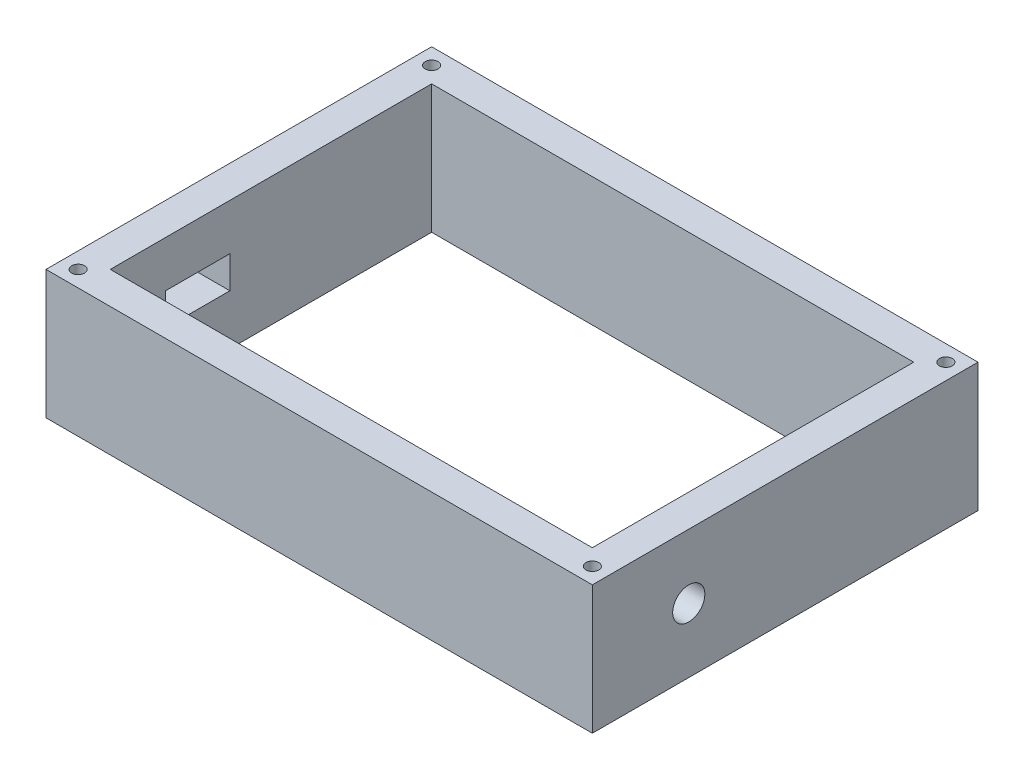
ISO-10303-21;
HEADER;
FILE_DESCRIPTION(('STEP AP214'),'2;1');
FILE_NAME('part.step','',(''),(''),'','','');
FILE_SCHEMA(('AUTOMOTIVE_DESIGN { 1 0 10303 214 1 1 1 1 }'));
ENDSEC;
DATA;
#1=APPLICATION_CONTEXT('core data for automotive mechanical design processes');
#2=APPLICATION_PROTOCOL_DEFINITION('international standard','automotive_design',2000,#1);
#3=PRODUCT_CONTEXT('',#1,'mechanical');
#4=PRODUCT('Part','Part','',(#3));
#5=PRODUCT_RELATED_PRODUCT_CATEGORY('part','',(#4));
#6=PRODUCT_DEFINITION_FORMATION('','',#4);
#7=PRODUCT_DEFINITION_CONTEXT('part definition',#1,'design');
#8=PRODUCT_DEFINITION('design','',#6,#7);
#9=PRODUCT_DEFINITION_SHAPE('','',#8);
#10=(LENGTH_UNIT() NAMED_UNIT(*) SI_UNIT(.MILLI.,.METRE.));
#11=(NAMED_UNIT(*) PLANE_ANGLE_UNIT() SI_UNIT($,.RADIAN.));
#12=(NAMED_UNIT(*) SI_UNIT($,.STERADIAN.) SOLID_ANGLE_UNIT());
#13=UNCERTAINTY_MEASURE_WITH_UNIT(LENGTH_MEASURE(1.E-05),#10,'distance_accuracy_value','');
#14=(GEOMETRIC_REPRESENTATION_CONTEXT(3) GLOBAL_UNCERTAINTY_ASSIGNED_CONTEXT((#13)) GLOBAL_UNIT_ASSIGNED_CONTEXT((#10,
#11,#12)) REPRESENTATION_CONTEXT('',''));
#15=CARTESIAN_POINT('',(0.,0.,0.));
#16=DIRECTION('',(0.,0.,1.));
#17=DIRECTION('',(1.,0.,0.));
#18=AXIS2_PLACEMENT_3D('',#15,#16,#17);
#19=CARTESIAN_POINT('',(0.,40.,0.));
#20=DIRECTION('',(0.,1.,0.));
#21=DIRECTION('',(0.,0.,1.));
#22=AXIS2_PLACEMENT_3D('',#19,#20,#21);
#23=PLANE('',#22);
#24=CARTESIAN_POINT('',(80.,40.,-55.));
#25=DIRECTION('',(0.,1.,0.));
#26=DIRECTION('',(0.,0.,1.));
#27=AXIS2_PLACEMENT_3D('',#24,#25,#26);
#28=CIRCLE('',#27,1.99999999999999);
#29=CARTESIAN_POINT('',(80.,40.,-53.));
#30=VERTEX_POINT('',#29);
#31=EDGE_CURVE('E208',#30,#30,#28,.T.);
#32=ORIENTED_EDGE('',*,*,#31,.F.);
#33=EDGE_LOOP('',(#32));
#34=FACE_BOUND('',#33,.T.);
#35=CARTESIAN_POINT('',(80.,40.,55.));
#36=DIRECTION('',(0.,1.,0.));
#37=DIRECTION('',(0.,0.,1.));
#38=AXIS2_PLACEMENT_3D('',#35,#36,#37);
#39=CIRCLE('',#38,1.99999999999999);
#40=CARTESIAN_POINT('',(80.,40.,57.));
#41=VERTEX_POINT('',#40);
#42=EDGE_CURVE('E221',#41,#41,#39,.T.);
#43=ORIENTED_EDGE('',*,*,#42,.F.);
#44=EDGE_LOOP('',(#43));
#45=FACE_BOUND('',#44,.T.);
#46=CARTESIAN_POINT('',(-80.,40.,55.));
#47=DIRECTION('',(0.,1.,0.));
#48=DIRECTION('',(0.,0.,1.));
#49=AXIS2_PLACEMENT_3D('',#46,#47,#48);
#50=CIRCLE('',#49,1.99999999999999);
#51=CARTESIAN_POINT('',(-80.,40.,57.));
#52=VERTEX_POINT('',#51);
#53=EDGE_CURVE('E229',#52,#52,#50,.T.);
#54=ORIENTED_EDGE('',*,*,#53,.F.);
#55=EDGE_LOOP('',(#54));
#56=FACE_BOUND('',#55,.T.);
#57=CARTESIAN_POINT('',(-80.,40.,-55.));
#58=DIRECTION('',(0.,1.,0.));
#59=DIRECTION('',(0.,0.,1.));
#60=AXIS2_PLACEMENT_3D('',#57,#58,#59);
#61=CIRCLE('',#60,1.99999999999999);
#62=CARTESIAN_POINT('',(-80.,40.,-53.));
#63=VERTEX_POINT('',#62);
#64=EDGE_CURVE('E237',#63,#63,#61,.T.);
#65=ORIENTED_EDGE('',*,*,#64,.F.);
#66=EDGE_LOOP('',(#65));
#67=FACE_BOUND('',#66,.T.);
#68=DIRECTION('',(0.,0.,-1.));
#69=VECTOR('',#68,1.);
#70=CARTESIAN_POINT('',(85.,40.,50.));
#71=LINE('',#70,#69);
#72=CARTESIAN_POINT('',(85.,40.,60.));
#73=VERTEX_POINT('',#72);
#74=CARTESIAN_POINT('',(85.,40.,-60.));
#75=VERTEX_POINT('',#74);
#76=EDGE_CURVE('E298',#73,#75,#71,.T.);
#77=ORIENTED_EDGE('',*,*,#76,.T.);
#78=DIRECTION('',(-1.,0.,0.));
#79=VECTOR('',#78,1.);
#80=CARTESIAN_POINT('',(75.,40.,-60.));
#81=LINE('',#80,#79);
#82=CARTESIAN_POINT('',(-85.,40.,-60.));
#83=VERTEX_POINT('',#82);
#84=EDGE_CURVE('E302',#75,#83,#81,.T.);
#85=ORIENTED_EDGE('',*,*,#84,.T.);
#86=DIRECTION('',(0.,0.,-1.));
#87=VECTOR('',#86,1.);
#88=CARTESIAN_POINT('',(-85.,40.,50.));
#89=LINE('',#88,#87);
#90=CARTESIAN_POINT('',(-85.,40.,60.));
#91=VERTEX_POINT('',#90);
#92=EDGE_CURVE('E306',#91,#83,#89,.T.);
#93=ORIENTED_EDGE('',*,*,#92,.F.);
#94=DIRECTION('',(-1.,0.,0.));
#95=VECTOR('',#94,1.);
#96=CARTESIAN_POINT('',(75.,40.,60.));
#97=LINE('',#96,#95);
#98=EDGE_CURVE('E310',#73,#91,#97,.T.);
#99=ORIENTED_EDGE('',*,*,#98,.F.);
#100=EDGE_LOOP('',(#77,#85,#93,#99));
#101=FACE_BOUND('',#100,.T.);
#102=DIRECTION('',(-1.,0.,0.));
#103=VECTOR('',#102,1.);
#104=CARTESIAN_POINT('',(75.,40.,-50.));
#105=LINE('',#104,#103);
#106=CARTESIAN_POINT('',(75.,40.,-50.));
#107=VERTEX_POINT('',#106);
#108=CARTESIAN_POINT('',(-75.,40.,-50.));
#109=VERTEX_POINT('',#108);
#110=EDGE_CURVE('E257',#107,#109,#105,.T.);
#111=ORIENTED_EDGE('',*,*,#110,.F.);
#112=DIRECTION('',(0.,0.,-1.));
#113=VECTOR('',#112,1.);
#114=CARTESIAN_POINT('',(75.,40.,50.));
#115=LINE('',#114,#113);
#116=CARTESIAN_POINT('',(75.,40.,50.));
#117=VERTEX_POINT('',#116);
#118=EDGE_CURVE('E254',#117,#107,#115,.T.);
#119=ORIENTED_EDGE('',*,*,#118,.F.);
#120=DIRECTION('',(-1.,0.,0.));
#121=VECTOR('',#120,1.);
#122=CARTESIAN_POINT('',(75.,40.,50.));
#123=LINE('',#122,#121);
#124=CARTESIAN_POINT('',(-75.,40.,50.));
#125=VERTEX_POINT('',#124);
#126=EDGE_CURVE('E265',#117,#125,#123,.T.);
#127=ORIENTED_EDGE('',*,*,#126,.T.);
#128=DIRECTION('',(0.,0.,-1.));
#129=VECTOR('',#128,1.);
#130=CARTESIAN_POINT('',(-75.,40.,50.));
#131=LINE('',#130,#129);
#132=EDGE_CURVE('E261',#125,#109,#131,.T.);
#133=ORIENTED_EDGE('',*,*,#132,.T.);
#134=EDGE_LOOP('',(#111,#119,#127,#133));
#135=FACE_BOUND('',#134,.T.);
#136=ADVANCED_FACE('F63',(#34,#45,#56,#67,#101,#135),#23,.T.);
#137=CARTESIAN_POINT('',(0.,0.,0.));
#138=DIRECTION('',(0.,1.,0.));
#139=DIRECTION('',(0.,0.,1.));
#140=AXIS2_PLACEMENT_3D('',#137,#138,#139);
#141=PLANE('',#140);
#142=DIRECTION('',(0.,0.,-1.));
#143=VECTOR('',#142,1.);
#144=CARTESIAN_POINT('',(85.,0.,50.));
#145=LINE('',#144,#143);
#146=CARTESIAN_POINT('',(85.,0.,60.));
#147=VERTEX_POINT('',#146);
#148=CARTESIAN_POINT('',(85.,0.,-60.));
#149=VERTEX_POINT('',#148);
#150=EDGE_CURVE('E297',#147,#149,#145,.T.);
#151=ORIENTED_EDGE('',*,*,#150,.F.);
#152=DIRECTION('',(-1.,0.,0.));
#153=VECTOR('',#152,1.);
#154=CARTESIAN_POINT('',(75.,0.,60.));
#155=LINE('',#154,#153);
#156=CARTESIAN_POINT('',(-85.,0.,60.));
#157=VERTEX_POINT('',#156);
#158=EDGE_CURVE('E303',#147,#157,#155,.T.);
#159=ORIENTED_EDGE('',*,*,#158,.T.);
#160=DIRECTION('',(0.,0.,-1.));
#161=VECTOR('',#160,1.);
#162=CARTESIAN_POINT('',(-85.,0.,50.));
#163=LINE('',#162,#161);
#164=CARTESIAN_POINT('',(-85.,0.,-60.));
#165=VERTEX_POINT('',#164);
#166=EDGE_CURVE('E322',#157,#165,#163,.T.);
#167=ORIENTED_EDGE('',*,*,#166,.T.);
#168=DIRECTION('',(-1.,0.,0.));
#169=VECTOR('',#168,1.);
#170=CARTESIAN_POINT('',(75.,0.,-60.));
#171=LINE('',#170,#169);
#172=EDGE_CURVE('E318',#149,#165,#171,.T.);
#173=ORIENTED_EDGE('',*,*,#172,.F.);
#174=EDGE_LOOP('',(#151,#159,#167,#173));
#175=FACE_BOUND('',#174,.T.);
#176=DIRECTION('',(0.,0.,-1.));
#177=VECTOR('',#176,1.);
#178=CARTESIAN_POINT('',(75.,0.,50.));
#179=LINE('',#178,#177);
#180=CARTESIAN_POINT('',(75.,0.,50.));
#181=VERTEX_POINT('',#180);
#182=CARTESIAN_POINT('',(75.,0.,-50.));
#183=VERTEX_POINT('',#182);
#184=EDGE_CURVE('E250',#181,#183,#179,.T.);
#185=ORIENTED_EDGE('',*,*,#184,.T.);
#186=DIRECTION('',(-1.,0.,0.));
#187=VECTOR('',#186,1.);
#188=CARTESIAN_POINT('',(75.,0.,-50.));
#189=LINE('',#188,#187);
#190=CARTESIAN_POINT('',(-75.,0.,-50.));
#191=VERTEX_POINT('',#190);
#192=EDGE_CURVE('E273',#183,#191,#189,.T.);
#193=ORIENTED_EDGE('',*,*,#192,.T.);
#194=DIRECTION('',(0.,0.,-1.));
#195=VECTOR('',#194,1.);
#196=CARTESIAN_POINT('',(-75.,0.,50.));
#197=LINE('',#196,#195);
#198=CARTESIAN_POINT('',(-75.,0.,50.));
#199=VERTEX_POINT('',#198);
#200=EDGE_CURVE('E277',#199,#191,#197,.T.);
#201=ORIENTED_EDGE('',*,*,#200,.F.);
#202=DIRECTION('',(-1.,0.,0.));
#203=VECTOR('',#202,1.);
#204=CARTESIAN_POINT('',(75.,0.,50.));
#205=LINE('',#204,#203);
#206=EDGE_CURVE('E258',#181,#199,#205,.T.);
#207=ORIENTED_EDGE('',*,*,#206,.F.);
#208=EDGE_LOOP('',(#185,#193,#201,#207));
#209=FACE_BOUND('',#208,.T.);
#210=ADVANCED_FACE('F344',(#175,#209),#141,.F.);
#211=CARTESIAN_POINT('',(85.,40.,50.));
#212=DIRECTION('',(-1.,0.,0.));
#213=DIRECTION('',(0.,0.,1.));
#214=AXIS2_PLACEMENT_3D('',#211,#212,#213);
#215=PLANE('',#214);
#216=CARTESIAN_POINT('',(85.,20.,30.));
#217=DIRECTION('',(1.,0.,0.));
#218=DIRECTION('',(0.,0.,-1.));
#219=AXIS2_PLACEMENT_3D('',#216,#217,#218);
#220=CIRCLE('',#219,5.);
#221=CARTESIAN_POINT('',(85.,20.,25.));
#222=VERTEX_POINT('',#221);
#223=EDGE_CURVE('E245',#222,#222,#220,.T.);
#224=ORIENTED_EDGE('',*,*,#223,.F.);
#225=EDGE_LOOP('',(#224));
#226=FACE_BOUND('',#225,.T.);
#227=ORIENTED_EDGE('',*,*,#150,.T.);
#228=DIRECTION('',(0.,-1.,0.));
#229=VECTOR('',#228,1.);
#230=CARTESIAN_POINT('',(85.,40.,-60.));
#231=LINE('',#230,#229);
#232=EDGE_CURVE('E12',#75,#149,#231,.T.);
#233=ORIENTED_EDGE('',*,*,#232,.F.);
#234=ORIENTED_EDGE('',*,*,#76,.F.);
#235=DIRECTION('',(0.,-1.,0.));
#236=VECTOR('',#235,1.);
#237=CARTESIAN_POINT('',(85.,40.,60.));
#238=LINE('',#237,#236);
#239=EDGE_CURVE('E314',#73,#147,#238,.T.);
#240=ORIENTED_EDGE('',*,*,#239,.T.);
#241=EDGE_LOOP('',(#227,#233,#234,#240));
#242=FACE_BOUND('',#241,.T.);
#243=ADVANCED_FACE('F65',(#226,#242),#215,.F.);
#244=CARTESIAN_POINT('',(75.,40.,-60.));
#245=DIRECTION('',(0.,0.,1.));
#246=DIRECTION('',(1.,0.,0.));
#247=AXIS2_PLACEMENT_3D('',#244,#245,#246);
#248=PLANE('',#247);
#249=ORIENTED_EDGE('',*,*,#172,.T.);
#250=DIRECTION('',(0.,-1.,0.));
#251=VECTOR('',#250,1.);
#252=CARTESIAN_POINT('',(-85.,40.,-60.));
#253=LINE('',#252,#251);
#254=EDGE_CURVE('E72',#83,#165,#253,.T.);
#255=ORIENTED_EDGE('',*,*,#254,.F.);
#256=ORIENTED_EDGE('',*,*,#84,.F.);
#257=ORIENTED_EDGE('',*,*,#232,.T.);
#258=EDGE_LOOP('',(#249,#255,#256,#257));
#259=FACE_BOUND('',#258,.T.);
#260=ADVANCED_FACE('F340',(#259),#248,.F.);
#261=CARTESIAN_POINT('',(-85.,40.,50.));
#262=DIRECTION('',(-1.,0.,0.));
#263=DIRECTION('',(0.,0.,1.));
#264=AXIS2_PLACEMENT_3D('',#261,#262,#263);
#265=PLANE('',#264);
#266=DIRECTION('',(0.,1.,0.));
#267=VECTOR('',#266,1.);
#268=CARTESIAN_POINT('',(-85.,25.6312398878282,32.785330455244));
#269=LINE('',#268,#267);
#270=CARTESIAN_POINT('',(-85.,15.6312398878282,32.785330455244));
#271=VERTEX_POINT('',#270);
#272=CARTESIAN_POINT('',(-85.,25.6312398878282,32.785330455244));
#273=VERTEX_POINT('',#272);
#274=EDGE_CURVE('E79',#271,#273,#269,.T.);
#275=ORIENTED_EDGE('',*,*,#274,.F.);
#276=DIRECTION('',(0.,0.,1.));
#277=VECTOR('',#276,1.);
#278=CARTESIAN_POINT('',(-85.,15.6312398878282,12.785330455244));
#279=LINE('',#278,#277);
#280=CARTESIAN_POINT('',(-85.,15.6312398878282,12.785330455244));
#281=VERTEX_POINT('',#280);
#282=EDGE_CURVE('E186',#281,#271,#279,.T.);
#283=ORIENTED_EDGE('',*,*,#282,.F.);
#284=DIRECTION('',(0.,-1.,0.));
#285=VECTOR('',#284,1.);
#286=CARTESIAN_POINT('',(-85.,25.6312398878282,12.785330455244));
#287=LINE('',#286,#285);
#288=CARTESIAN_POINT('',(-85.,25.6312398878282,12.785330455244));
#289=VERTEX_POINT('',#288);
#290=EDGE_CURVE('E190',#289,#281,#287,.T.);
#291=ORIENTED_EDGE('',*,*,#290,.F.);
#292=DIRECTION('',(0.,0.,-1.));
#293=VECTOR('',#292,1.);
#294=CARTESIAN_POINT('',(-85.,25.6312398878282,12.785330455244));
#295=LINE('',#294,#293);
#296=EDGE_CURVE('E199',#273,#289,#295,.T.);
#297=ORIENTED_EDGE('',*,*,#296,.F.);
#298=EDGE_LOOP('',(#275,#283,#291,#297));
#299=FACE_BOUND('',#298,.T.);
#300=ORIENTED_EDGE('',*,*,#166,.F.);
#301=DIRECTION('',(0.,-1.,0.));
#302=VECTOR('',#301,1.);
#303=CARTESIAN_POINT('',(-85.,40.,60.));
#304=LINE('',#303,#302);
#305=EDGE_CURVE('E331',#91,#157,#304,.T.);
#306=ORIENTED_EDGE('',*,*,#305,.F.);
#307=ORIENTED_EDGE('',*,*,#92,.T.);
#308=ORIENTED_EDGE('',*,*,#254,.T.);
#309=EDGE_LOOP('',(#300,#306,#307,#308));
#310=FACE_BOUND('',#309,.T.);
#311=ADVANCED_FACE('F337',(#299,#310),#265,.T.);
#312=CARTESIAN_POINT('',(75.,40.,60.));
#313=DIRECTION('',(0.,0.,1.));
#314=DIRECTION('',(1.,0.,0.));
#315=AXIS2_PLACEMENT_3D('',#312,#313,#314);
#316=PLANE('',#315);
#317=ORIENTED_EDGE('',*,*,#158,.F.);
#318=ORIENTED_EDGE('',*,*,#239,.F.);
#319=ORIENTED_EDGE('',*,*,#98,.T.);
#320=ORIENTED_EDGE('',*,*,#305,.T.);
#321=EDGE_LOOP('',(#317,#318,#319,#320));
#322=FACE_BOUND('',#321,.T.);
#323=ADVANCED_FACE('F348',(#322),#316,.T.);
#324=CARTESIAN_POINT('',(75.,40.,50.));
#325=DIRECTION('',(-1.,0.,0.));
#326=DIRECTION('',(0.,0.,1.));
#327=AXIS2_PLACEMENT_3D('',#324,#325,#326);
#328=PLANE('',#327);
#329=CARTESIAN_POINT('',(75.,20.,30.));
#330=DIRECTION('',(1.,0.,0.));
#331=DIRECTION('',(0.,0.,-1.));
#332=AXIS2_PLACEMENT_3D('',#329,#330,#331);
#333=CIRCLE('',#332,5.);
#334=CARTESIAN_POINT('',(75.,20.,25.));
#335=VERTEX_POINT('',#334);
#336=EDGE_CURVE('E246',#335,#335,#333,.T.);
#337=ORIENTED_EDGE('',*,*,#336,.T.);
#338=EDGE_LOOP('',(#337));
#339=FACE_BOUND('',#338,.T.);
#340=ORIENTED_EDGE('',*,*,#184,.F.);
#341=DIRECTION('',(0.,-1.,0.));
#342=VECTOR('',#341,1.);
#343=CARTESIAN_POINT('',(75.,40.,50.));
#344=LINE('',#343,#342);
#345=EDGE_CURVE('E269',#117,#181,#344,.T.);
#346=ORIENTED_EDGE('',*,*,#345,.F.);
#347=ORIENTED_EDGE('',*,*,#118,.T.);
#348=DIRECTION('',(0.,-1.,0.));
#349=VECTOR('',#348,1.);
#350=CARTESIAN_POINT('',(75.,40.,-50.));
#351=LINE('',#350,#349);
#352=EDGE_CURVE('E293',#107,#183,#351,.T.);
#353=ORIENTED_EDGE('',*,*,#352,.T.);
#354=EDGE_LOOP('',(#340,#346,#347,#353));
#355=FACE_BOUND('',#354,.T.);
#356=ADVANCED_FACE('F370',(#339,#355),#328,.T.);
#357=CARTESIAN_POINT('',(75.,40.,-50.));
#358=DIRECTION('',(0.,0.,1.));
#359=DIRECTION('',(1.,0.,0.));
#360=AXIS2_PLACEMENT_3D('',#357,#358,#359);
#361=PLANE('',#360);
#362=ORIENTED_EDGE('',*,*,#192,.F.);
#363=ORIENTED_EDGE('',*,*,#352,.F.);
#364=ORIENTED_EDGE('',*,*,#110,.T.);
#365=DIRECTION('',(0.,-1.,0.));
#366=VECTOR('',#365,1.);
#367=CARTESIAN_POINT('',(-75.,40.,-50.));
#368=LINE('',#367,#366);
#369=EDGE_CURVE('E290',#109,#191,#368,.T.);
#370=ORIENTED_EDGE('',*,*,#369,.T.);
#371=EDGE_LOOP('',(#362,#363,#364,#370));
#372=FACE_BOUND('',#371,.T.);
#373=ADVANCED_FACE('F436',(#372),#361,.T.);
#374=CARTESIAN_POINT('',(-75.,40.,50.));
#375=DIRECTION('',(-1.,0.,0.));
#376=DIRECTION('',(0.,0.,1.));
#377=AXIS2_PLACEMENT_3D('',#374,#375,#376);
#378=PLANE('',#377);
#379=DIRECTION('',(0.,0.,1.));
#380=VECTOR('',#379,1.);
#381=CARTESIAN_POINT('',(-75.,15.6312398878282,12.785330455244));
#382=LINE('',#381,#380);
#383=CARTESIAN_POINT('',(-75.,15.6312398878282,12.785330455244));
#384=VERTEX_POINT('',#383);
#385=CARTESIAN_POINT('',(-75.,15.6312398878282,32.785330455244));
#386=VERTEX_POINT('',#385);
#387=EDGE_CURVE('E174',#384,#386,#382,.T.);
#388=ORIENTED_EDGE('',*,*,#387,.T.);
#389=DIRECTION('',(0.,1.,0.));
#390=VECTOR('',#389,1.);
#391=CARTESIAN_POINT('',(-75.,25.6312398878282,32.785330455244));
#392=LINE('',#391,#390);
#393=CARTESIAN_POINT('',(-75.,25.6312398878282,32.785330455244));
#394=VERTEX_POINT('',#393);
#395=EDGE_CURVE('E167',#386,#394,#392,.T.);
#396=ORIENTED_EDGE('',*,*,#395,.T.);
#397=DIRECTION('',(0.,0.,-1.));
#398=VECTOR('',#397,1.);
#399=CARTESIAN_POINT('',(-75.,25.6312398878282,12.785330455244));
#400=LINE('',#399,#398);
#401=CARTESIAN_POINT('',(-75.,25.6312398878282,12.785330455244));
#402=VERTEX_POINT('',#401);
#403=EDGE_CURVE('E177',#394,#402,#400,.T.);
#404=ORIENTED_EDGE('',*,*,#403,.T.);
#405=DIRECTION('',(0.,-1.,0.));
#406=VECTOR('',#405,1.);
#407=CARTESIAN_POINT('',(-75.,25.6312398878282,12.785330455244));
#408=LINE('',#407,#406);
#409=EDGE_CURVE('E87',#402,#384,#408,.T.);
#410=ORIENTED_EDGE('',*,*,#409,.T.);
#411=EDGE_LOOP('',(#388,#396,#404,#410));
#412=FACE_BOUND('',#411,.T.);
#413=ORIENTED_EDGE('',*,*,#200,.T.);
#414=ORIENTED_EDGE('',*,*,#369,.F.);
#415=ORIENTED_EDGE('',*,*,#132,.F.);
#416=DIRECTION('',(0.,-1.,0.));
#417=VECTOR('',#416,1.);
#418=CARTESIAN_POINT('',(-75.,40.,50.));
#419=LINE('',#418,#417);
#420=EDGE_CURVE('E287',#125,#199,#419,.T.);
#421=ORIENTED_EDGE('',*,*,#420,.T.);
#422=EDGE_LOOP('',(#413,#414,#415,#421));
#423=FACE_BOUND('',#422,.T.);
#424=ADVANCED_FACE('F182',(#412,#423),#378,.F.);
#425=CARTESIAN_POINT('',(75.,40.,50.));
#426=DIRECTION('',(0.,0.,1.));
#427=DIRECTION('',(1.,0.,0.));
#428=AXIS2_PLACEMENT_3D('',#425,#426,#427);
#429=PLANE('',#428);
#430=ORIENTED_EDGE('',*,*,#206,.T.);
#431=ORIENTED_EDGE('',*,*,#420,.F.);
#432=ORIENTED_EDGE('',*,*,#126,.F.);
#433=ORIENTED_EDGE('',*,*,#345,.T.);
#434=EDGE_LOOP('',(#430,#431,#432,#433));
#435=FACE_BOUND('',#434,.T.);
#436=ADVANCED_FACE('F430',(#435),#429,.F.);
#437=CARTESIAN_POINT('',(75.,20.,30.));
#438=DIRECTION('',(1.,0.,0.));
#439=DIRECTION('',(0.,0.,-1.));
#440=AXIS2_PLACEMENT_3D('',#437,#438,#439);
#441=CYLINDRICAL_SURFACE('',#440,5.);
#442=ORIENTED_EDGE('',*,*,#336,.F.);
#443=EDGE_LOOP('',(#442));
#444=FACE_BOUND('',#443,.T.);
#445=ORIENTED_EDGE('',*,*,#223,.T.);
#446=EDGE_LOOP('',(#445));
#447=FACE_BOUND('',#446,.T.);
#448=ADVANCED_FACE('F426',(#444,#447),#441,.F.);
#449=CARTESIAN_POINT('',(-80.,35.,-55.));
#450=DIRECTION('',(0.,1.,0.));
#451=DIRECTION('',(0.,0.,1.));
#452=AXIS2_PLACEMENT_3D('',#449,#450,#451);
#453=CONICAL_SURFACE('',#452,1.99999999999999,1.02974425867665);
#454=CARTESIAN_POINT('',(-80.,33.7982787619449,-55.));
#455=VERTEX_POINT('',#454);
#456=VERTEX_LOOP('',#455);
#457=FACE_BOUND('',#456,.T.);
#458=CARTESIAN_POINT('',(-80.,35.,-55.));
#459=DIRECTION('',(0.,1.,0.));
#460=DIRECTION('',(0.,0.,1.));
#461=AXIS2_PLACEMENT_3D('',#458,#459,#460);
#462=CIRCLE('',#461,1.99999999999999);
#463=CARTESIAN_POINT('',(-80.,35.,-53.));
#464=VERTEX_POINT('',#463);
#465=EDGE_CURVE('E241',#464,#464,#462,.T.);
#466=ORIENTED_EDGE('',*,*,#465,.T.);
#467=EDGE_LOOP('',(#466));
#468=FACE_BOUND('',#467,.T.);
#469=ADVANCED_FACE('F422',(#457,#468),#453,.F.);
#470=CARTESIAN_POINT('',(-80.,40.,-55.));
#471=DIRECTION('',(0.,1.,0.));
#472=DIRECTION('',(0.,0.,1.));
#473=AXIS2_PLACEMENT_3D('',#470,#471,#472);
#474=CYLINDRICAL_SURFACE('',#473,1.99999999999999);
#475=ORIENTED_EDGE('',*,*,#465,.F.);
#476=EDGE_LOOP('',(#475));
#477=FACE_BOUND('',#476,.T.);
#478=ORIENTED_EDGE('',*,*,#64,.T.);
#479=EDGE_LOOP('',(#478));
#480=FACE_BOUND('',#479,.T.);
#481=ADVANCED_FACE('F418',(#477,#480),#474,.F.);
#482=CARTESIAN_POINT('',(-80.,35.,55.));
#483=DIRECTION('',(0.,1.,0.));
#484=DIRECTION('',(0.,0.,1.));
#485=AXIS2_PLACEMENT_3D('',#482,#483,#484);
#486=CONICAL_SURFACE('',#485,1.99999999999999,1.02974425867665);
#487=CARTESIAN_POINT('',(-80.,33.7982787619449,55.));
#488=VERTEX_POINT('',#487);
#489=VERTEX_LOOP('',#488);
#490=FACE_BOUND('',#489,.T.);
#491=CARTESIAN_POINT('',(-80.,35.,55.));
#492=DIRECTION('',(0.,1.,0.));
#493=DIRECTION('',(0.,0.,1.));
#494=AXIS2_PLACEMENT_3D('',#491,#492,#493);
#495=CIRCLE('',#494,1.99999999999999);
#496=CARTESIAN_POINT('',(-80.,35.,57.));
#497=VERTEX_POINT('',#496);
#498=EDGE_CURVE('E233',#497,#497,#495,.T.);
#499=ORIENTED_EDGE('',*,*,#498,.T.);
#500=EDGE_LOOP('',(#499));
#501=FACE_BOUND('',#500,.T.);
#502=ADVANCED_FACE('F414',(#490,#501),#486,.F.);
#503=CARTESIAN_POINT('',(-80.,40.,55.));
#504=DIRECTION('',(0.,1.,0.));
#505=DIRECTION('',(0.,0.,1.));
#506=AXIS2_PLACEMENT_3D('',#503,#504,#505);
#507=CYLINDRICAL_SURFACE('',#506,1.99999999999999);
#508=ORIENTED_EDGE('',*,*,#498,.F.);
#509=EDGE_LOOP('',(#508));
#510=FACE_BOUND('',#509,.T.);
#511=ORIENTED_EDGE('',*,*,#53,.T.);
#512=EDGE_LOOP('',(#511));
#513=FACE_BOUND('',#512,.T.);
#514=ADVANCED_FACE('F410',(#510,#513),#507,.F.);
#515=CARTESIAN_POINT('',(80.,35.,55.));
#516=DIRECTION('',(0.,1.,0.));
#517=DIRECTION('',(0.,0.,1.));
#518=AXIS2_PLACEMENT_3D('',#515,#516,#517);
#519=CONICAL_SURFACE('',#518,1.99999999999999,1.02974425867665);
#520=CARTESIAN_POINT('',(80.,33.7982787619449,55.));
#521=VERTEX_POINT('',#520);
#522=VERTEX_LOOP('',#521);
#523=FACE_BOUND('',#522,.T.);
#524=CARTESIAN_POINT('',(80.,35.,55.));
#525=DIRECTION('',(0.,1.,0.));
#526=DIRECTION('',(0.,0.,1.));
#527=AXIS2_PLACEMENT_3D('',#524,#525,#526);
#528=CIRCLE('',#527,1.99999999999999);
#529=CARTESIAN_POINT('',(80.,35.,57.));
#530=VERTEX_POINT('',#529);
#531=EDGE_CURVE('E225',#530,#530,#528,.T.);
#532=ORIENTED_EDGE('',*,*,#531,.T.);
#533=EDGE_LOOP('',(#532));
#534=FACE_BOUND('',#533,.T.);
#535=ADVANCED_FACE('F406',(#523,#534),#519,.F.);
#536=CARTESIAN_POINT('',(80.,40.,55.));
#537=DIRECTION('',(0.,1.,0.));
#538=DIRECTION('',(0.,0.,1.));
#539=AXIS2_PLACEMENT_3D('',#536,#537,#538);
#540=CYLINDRICAL_SURFACE('',#539,1.99999999999999);
#541=ORIENTED_EDGE('',*,*,#531,.F.);
#542=EDGE_LOOP('',(#541));
#543=FACE_BOUND('',#542,.T.);
#544=ORIENTED_EDGE('',*,*,#42,.T.);
#545=EDGE_LOOP('',(#544));
#546=FACE_BOUND('',#545,.T.);
#547=ADVANCED_FACE('F402',(#543,#546),#540,.F.);
#548=CARTESIAN_POINT('',(80.,35.,-55.));
#549=DIRECTION('',(0.,1.,0.));
#550=DIRECTION('',(0.,0.,1.));
#551=AXIS2_PLACEMENT_3D('',#548,#549,#550);
#552=CONICAL_SURFACE('',#551,1.99999999999999,1.02974425867665);
#553=CARTESIAN_POINT('',(80.,33.7982787619449,-55.));
#554=VERTEX_POINT('',#553);
#555=VERTEX_LOOP('',#554);
#556=FACE_BOUND('',#555,.T.);
#557=CARTESIAN_POINT('',(80.,35.,-55.));
#558=DIRECTION('',(0.,1.,0.));
#559=DIRECTION('',(0.,0.,1.));
#560=AXIS2_PLACEMENT_3D('',#557,#558,#559);
#561=CIRCLE('',#560,1.99999999999999);
#562=CARTESIAN_POINT('',(80.,35.,-53.));
#563=VERTEX_POINT('',#562);
#564=EDGE_CURVE('E217',#563,#563,#561,.T.);
#565=ORIENTED_EDGE('',*,*,#564,.T.);
#566=EDGE_LOOP('',(#565));
#567=FACE_BOUND('',#566,.T.);
#568=ADVANCED_FACE('F398',(#556,#567),#552,.F.);
#569=CARTESIAN_POINT('',(80.,40.,-55.));
#570=DIRECTION('',(0.,1.,0.));
#571=DIRECTION('',(0.,0.,1.));
#572=AXIS2_PLACEMENT_3D('',#569,#570,#571);
#573=CYLINDRICAL_SURFACE('',#572,1.99999999999999);
#574=ORIENTED_EDGE('',*,*,#564,.F.);
#575=EDGE_LOOP('',(#574));
#576=FACE_BOUND('',#575,.T.);
#577=ORIENTED_EDGE('',*,*,#31,.T.);
#578=EDGE_LOOP('',(#577));
#579=FACE_BOUND('',#578,.T.);
#580=ADVANCED_FACE('F391',(#576,#579),#573,.F.);
#581=CARTESIAN_POINT('',(-75.,25.6312398878282,32.785330455244));
#582=DIRECTION('',(0.,0.,1.));
#583=DIRECTION('',(1.,0.,0.));
#584=AXIS2_PLACEMENT_3D('',#581,#582,#583);
#585=PLANE('',#584);
#586=ORIENTED_EDGE('',*,*,#274,.T.);
#587=DIRECTION('',(-1.,0.,0.));
#588=VECTOR('',#587,1.);
#589=CARTESIAN_POINT('',(-75.,25.6312398878282,32.785330455244));
#590=LINE('',#589,#588);
#591=EDGE_CURVE('E163',#394,#273,#590,.T.);
#592=ORIENTED_EDGE('',*,*,#591,.F.);
#593=ORIENTED_EDGE('',*,*,#395,.F.);
#594=DIRECTION('',(-1.,0.,0.));
#595=VECTOR('',#594,1.);
#596=CARTESIAN_POINT('',(-75.,15.6312398878282,32.785330455244));
#597=LINE('',#596,#595);
#598=EDGE_CURVE('E205',#386,#271,#597,.T.);
#599=ORIENTED_EDGE('',*,*,#598,.T.);
#600=EDGE_LOOP('',(#586,#592,#593,#599));
#601=FACE_BOUND('',#600,.T.);
#602=ADVANCED_FACE('F165',(#601),#585,.F.);
#603=CARTESIAN_POINT('',(-75.,15.6312398878282,12.785330455244));
#604=DIRECTION('',(0.,-1.,0.));
#605=DIRECTION('',(0.,0.,-1.));
#606=AXIS2_PLACEMENT_3D('',#603,#604,#605);
#607=PLANE('',#606);
#608=ORIENTED_EDGE('',*,*,#282,.T.);
#609=ORIENTED_EDGE('',*,*,#598,.F.);
#610=ORIENTED_EDGE('',*,*,#387,.F.);
#611=DIRECTION('',(-1.,0.,0.));
#612=VECTOR('',#611,1.);
#613=CARTESIAN_POINT('',(-75.,15.6312398878282,12.785330455244));
#614=LINE('',#613,#612);
#615=EDGE_CURVE('E209',#384,#281,#614,.T.);
#616=ORIENTED_EDGE('',*,*,#615,.T.);
#617=EDGE_LOOP('',(#608,#609,#610,#616));
#618=FACE_BOUND('',#617,.T.);
#619=ADVANCED_FACE('F383',(#618),#607,.F.);
#620=CARTESIAN_POINT('',(-75.,25.6312398878282,12.785330455244));
#621=DIRECTION('',(0.,0.,-1.));
#622=DIRECTION('',(0.,1.,0.));
#623=AXIS2_PLACEMENT_3D('',#620,#621,#622);
#624=PLANE('',#623);
#625=ORIENTED_EDGE('',*,*,#290,.T.);
#626=ORIENTED_EDGE('',*,*,#615,.F.);
#627=ORIENTED_EDGE('',*,*,#409,.F.);
#628=DIRECTION('',(-1.,0.,0.));
#629=VECTOR('',#628,1.);
#630=CARTESIAN_POINT('',(-75.,25.6312398878282,12.785330455244));
#631=LINE('',#630,#629);
#632=EDGE_CURVE('E173',#402,#289,#631,.T.);
#633=ORIENTED_EDGE('',*,*,#632,.T.);
#634=EDGE_LOOP('',(#625,#626,#627,#633));
#635=FACE_BOUND('',#634,.T.);
#636=ADVANCED_FACE('F381',(#635),#624,.F.);
#637=CARTESIAN_POINT('',(-75.,25.6312398878282,12.785330455244));
#638=DIRECTION('',(0.,1.,0.));
#639=DIRECTION('',(0.,0.,1.));
#640=AXIS2_PLACEMENT_3D('',#637,#638,#639);
#641=PLANE('',#640);
#642=ORIENTED_EDGE('',*,*,#296,.T.);
#643=ORIENTED_EDGE('',*,*,#632,.F.);
#644=ORIENTED_EDGE('',*,*,#403,.F.);
#645=ORIENTED_EDGE('',*,*,#591,.T.);
#646=EDGE_LOOP('',(#642,#643,#644,#645));
#647=FACE_BOUND('',#646,.T.);
#648=ADVANCED_FACE('F178',(#647),#641,.F.);
#649=CLOSED_SHELL('',(#136,#210,#243,#260,#311,#323,#356,#373,#424,#436,#448,#469,#481,#502,
#514,#535,#547,#568,#580,#602,#619,#636,#648));
#650=MANIFOLD_SOLID_BREP('B2',#649);
#651=ADVANCED_BREP_SHAPE_REPRESENTATION('',(#18,#650),#14);
#652=SHAPE_DEFINITION_REPRESENTATION(#9,#651);
ENDSEC;
END-ISO-10303-21;
